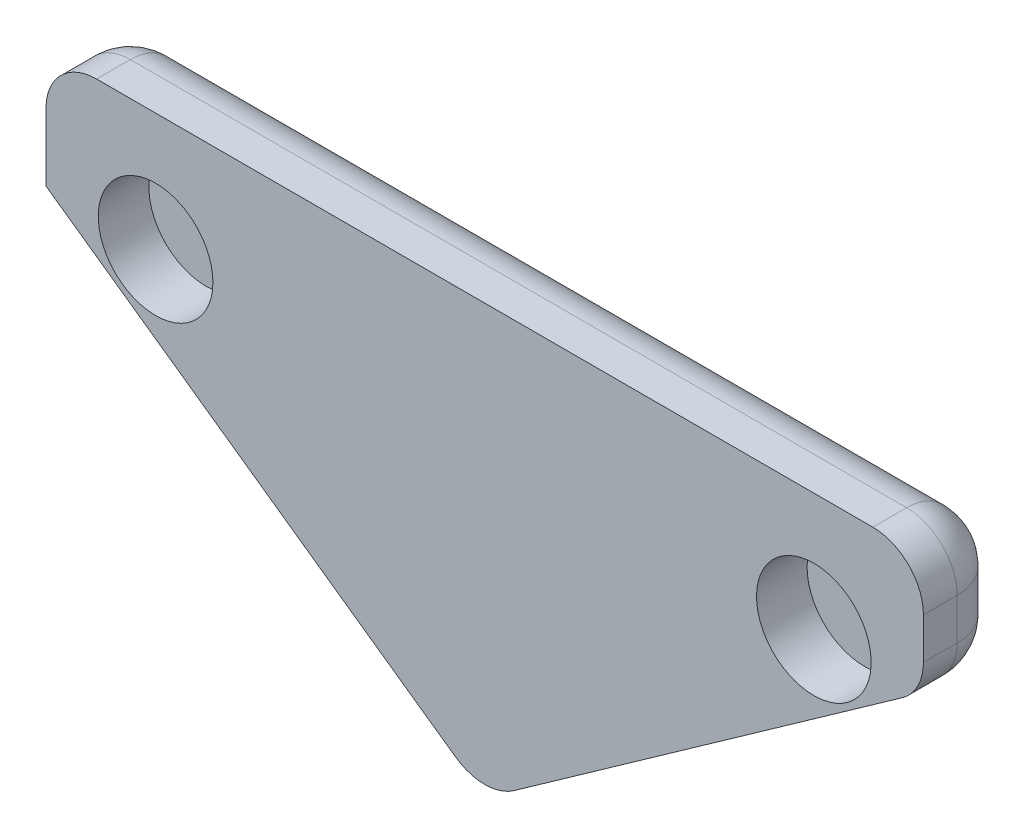
ISO-10303-21;
HEADER;
FILE_DESCRIPTION(('STEP AP214'),'2;1');
FILE_NAME('part.step','',(''),(''),'','','');
FILE_SCHEMA(('AUTOMOTIVE_DESIGN { 1 0 10303 214 1 1 1 1 }'));
ENDSEC;
DATA;
#1=APPLICATION_CONTEXT('core data for automotive mechanical design processes');
#2=APPLICATION_PROTOCOL_DEFINITION('international standard','automotive_design',2000,#1);
#3=PRODUCT_CONTEXT('',#1,'mechanical');
#4=PRODUCT('Part','Part','',(#3));
#5=PRODUCT_RELATED_PRODUCT_CATEGORY('part','',(#4));
#6=PRODUCT_DEFINITION_FORMATION('','',#4);
#7=PRODUCT_DEFINITION_CONTEXT('part definition',#1,'design');
#8=PRODUCT_DEFINITION('design','',#6,#7);
#9=PRODUCT_DEFINITION_SHAPE('','',#8);
#10=(LENGTH_UNIT() NAMED_UNIT(*) SI_UNIT(.MILLI.,.METRE.));
#11=(NAMED_UNIT(*) PLANE_ANGLE_UNIT() SI_UNIT($,.RADIAN.));
#12=(NAMED_UNIT(*) SI_UNIT($,.STERADIAN.) SOLID_ANGLE_UNIT());
#13=UNCERTAINTY_MEASURE_WITH_UNIT(LENGTH_MEASURE(1.E-05),#10,'distance_accuracy_value','');
#14=(GEOMETRIC_REPRESENTATION_CONTEXT(3) GLOBAL_UNCERTAINTY_ASSIGNED_CONTEXT((#13)) GLOBAL_UNIT_ASSIGNED_CONTEXT((#10,
#11,#12)) REPRESENTATION_CONTEXT('',''));
#15=CARTESIAN_POINT('',(0.,0.,0.));
#16=DIRECTION('',(0.,0.,1.));
#17=DIRECTION('',(1.,0.,0.));
#18=AXIS2_PLACEMENT_3D('',#15,#16,#17);
#19=CARTESIAN_POINT('',(5.44580381973494,12.7,2.5));
#20=DIRECTION('',(0.,-1.,0.));
#21=DIRECTION('',(1.,0.,0.));
#22=AXIS2_PLACEMENT_3D('',#19,#20,#21);
#23=PLANE('',#22);
#24=DIRECTION('',(-1.,0.,0.));
#25=VECTOR('',#24,1.);
#26=CARTESIAN_POINT('',(5.44580381973494,12.7,2.5));
#27=LINE('',#26,#25);
#28=CARTESIAN_POINT('',(16.9558038197349,12.7,2.5));
#29=VERTEX_POINT('',#28);
#30=CARTESIAN_POINT('',(-6.06419618026506,12.7,2.5));
#31=VERTEX_POINT('',#30);
#32=EDGE_CURVE('E145',#29,#31,#27,.T.);
#33=ORIENTED_EDGE('',*,*,#32,.F.);
#34=DIRECTION('',(0.,0.,-1.));
#35=VECTOR('',#34,1.);
#36=CARTESIAN_POINT('',(16.9558038197349,12.7,2.5));
#37=LINE('',#36,#35);
#38=CARTESIAN_POINT('',(16.9558038197349,12.7,1.5));
#39=VERTEX_POINT('',#38);
#40=EDGE_CURVE('E163',#29,#39,#37,.T.);
#41=ORIENTED_EDGE('',*,*,#40,.T.);
#42=DIRECTION('',(-1.,0.,0.));
#43=VECTOR('',#42,1.);
#44=CARTESIAN_POINT('',(5.44580381973494,12.7,1.5));
#45=LINE('',#44,#43);
#46=CARTESIAN_POINT('',(-6.06419618026506,12.7,1.5));
#47=VERTEX_POINT('',#46);
#48=EDGE_CURVE('E150',#39,#47,#45,.T.);
#49=ORIENTED_EDGE('',*,*,#48,.T.);
#50=DIRECTION('',(0.,0.,-1.));
#51=VECTOR('',#50,1.);
#52=CARTESIAN_POINT('',(-6.06419618026506,12.7,2.5));
#53=LINE('',#52,#51);
#54=EDGE_CURVE('E160',#47,#31,#53,.F.);
#55=ORIENTED_EDGE('',*,*,#54,.T.);
#56=EDGE_LOOP('',(#33,#41,#49,#55));
#57=FACE_BOUND('',#56,.T.);
#58=ADVANCED_FACE('F45',(#57),#23,.F.);
#59=CARTESIAN_POINT('',(-7.56419618026505,12.7,2.5));
#60=DIRECTION('',(1.,0.,0.));
#61=DIRECTION('',(0.,1.,0.));
#62=AXIS2_PLACEMENT_3D('',#59,#60,#61);
#63=PLANE('',#62);
#64=DIRECTION('',(0.,-1.,0.));
#65=VECTOR('',#64,1.);
#66=CARTESIAN_POINT('',(-7.56419618026505,12.7,2.5));
#67=LINE('',#66,#65);
#68=CARTESIAN_POINT('',(-7.56419618026506,11.2,2.5));
#69=VERTEX_POINT('',#68);
#70=CARTESIAN_POINT('',(-7.56419618026506,9.19999999999999,2.5));
#71=VERTEX_POINT('',#70);
#72=EDGE_CURVE('E133',#69,#71,#67,.T.);
#73=ORIENTED_EDGE('',*,*,#72,.F.);
#74=DIRECTION('',(0.,0.,-1.));
#75=VECTOR('',#74,1.);
#76=CARTESIAN_POINT('',(-7.56419618026506,11.2,2.5));
#77=LINE('',#76,#75);
#78=CARTESIAN_POINT('',(-7.56419618026506,11.2,1.5));
#79=VERTEX_POINT('',#78);
#80=EDGE_CURVE('E11',#69,#79,#77,.T.);
#81=ORIENTED_EDGE('',*,*,#80,.T.);
#82=DIRECTION('',(0.,-1.,0.));
#83=VECTOR('',#82,1.);
#84=CARTESIAN_POINT('',(-7.56419618026505,12.7,1.5));
#85=LINE('',#84,#83);
#86=CARTESIAN_POINT('',(-7.56419618026506,9.19999999999999,1.5));
#87=VERTEX_POINT('',#86);
#88=EDGE_CURVE('E55',#79,#87,#85,.T.);
#89=ORIENTED_EDGE('',*,*,#88,.T.);
#90=DIRECTION('',(0.,0.,-1.));
#91=VECTOR('',#90,1.);
#92=CARTESIAN_POINT('',(-7.56419618026506,9.19999999999999,2.5));
#93=LINE('',#92,#91);
#94=EDGE_CURVE('E147',#71,#87,#93,.T.);
#95=ORIENTED_EDGE('',*,*,#94,.F.);
#96=EDGE_LOOP('',(#73,#81,#89,#95));
#97=FACE_BOUND('',#96,.T.);
#98=ADVANCED_FACE('F148',(#97),#63,.F.);
#99=CARTESIAN_POINT('',(-7.56419618026506,9.19999999999999,2.5));
#100=DIRECTION('',(0.577372894319039,0.816480582075076,0.));
#101=DIRECTION('',(-0.816480582075076,0.577372894319039,0.));
#102=AXIS2_PLACEMENT_3D('',#99,#100,#101);
#103=PLANE('',#102);
#104=DIRECTION('',(0.816480582075076,-0.577372894319039,0.));
#105=VECTOR('',#104,1.);
#106=CARTESIAN_POINT('',(-7.56419618026506,9.19999999999999,1.5));
#107=LINE('',#106,#105);
#108=CARTESIAN_POINT('',(4.57974447825638,0.612432432098591,1.5));
#109=VERTEX_POINT('',#108);
#110=EDGE_CURVE('E69',#87,#109,#107,.T.);
#111=ORIENTED_EDGE('',*,*,#110,.T.);
#112=DIRECTION('',(0.,0.,-1.));
#113=VECTOR('',#112,1.);
#114=CARTESIAN_POINT('',(4.57974447825638,0.612432432098591,2.5));
#115=LINE('',#114,#113);
#116=CARTESIAN_POINT('',(4.57974447825638,0.612432432098591,2.5));
#117=VERTEX_POINT('',#116);
#118=EDGE_CURVE('E153',#109,#117,#115,.F.);
#119=ORIENTED_EDGE('',*,*,#118,.T.);
#120=DIRECTION('',(0.816480582075076,-0.577372894319039,0.));
#121=VECTOR('',#120,1.);
#122=CARTESIAN_POINT('',(-7.56419618026506,9.19999999999999,2.5));
#123=LINE('',#122,#121);
#124=EDGE_CURVE('E139',#71,#117,#123,.T.);
#125=ORIENTED_EDGE('',*,*,#124,.F.);
#126=ORIENTED_EDGE('',*,*,#94,.T.);
#127=EDGE_LOOP('',(#111,#119,#125,#126));
#128=FACE_BOUND('',#127,.T.);
#129=ADVANCED_FACE('F152',(#128),#103,.F.);
#130=CARTESIAN_POINT('',(0.,0.,2.5));
#131=DIRECTION('',(0.,0.,1.));
#132=DIRECTION('',(1.,0.,0.));
#133=AXIS2_PLACEMENT_3D('',#130,#131,#132);
#134=PLANE('',#133);
#135=CARTESIAN_POINT('',(-4.31419618026505,9.2,2.5));
#136=DIRECTION('',(0.,0.,1.));
#137=DIRECTION('',(1.,0.,0.));
#138=AXIS2_PLACEMENT_3D('',#135,#136,#137);
#139=CIRCLE('',#138,1.7);
#140=CARTESIAN_POINT('',(-2.61419618026505,9.2,2.5));
#141=VERTEX_POINT('',#140);
#142=EDGE_CURVE('E286',#141,#141,#139,.T.);
#143=ORIENTED_EDGE('',*,*,#142,.F.);
#144=EDGE_LOOP('',(#143));
#145=FACE_BOUND('',#144,.T.);
#146=DIRECTION('',(0.,-1.,0.));
#147=VECTOR('',#146,1.);
#148=CARTESIAN_POINT('',(18.4558038197349,12.7,2.5));
#149=LINE('',#148,#147);
#150=CARTESIAN_POINT('',(18.4558038197349,11.2,2.5));
#151=VERTEX_POINT('',#150);
#152=CARTESIAN_POINT('',(18.4558038197349,9.97643078407362,2.5));
#153=VERTEX_POINT('',#152);
#154=EDGE_CURVE('E276',#151,#153,#149,.T.);
#155=ORIENTED_EDGE('',*,*,#154,.F.);
#156=CARTESIAN_POINT('',(16.9558038197349,11.2,2.5));
#157=DIRECTION('',(0.,0.,1.));
#158=DIRECTION('',(1.,0.,0.));
#159=AXIS2_PLACEMENT_3D('',#156,#157,#158);
#160=CIRCLE('',#159,1.5);
#161=EDGE_CURVE('E184',#151,#29,#160,.T.);
#162=ORIENTED_EDGE('',*,*,#161,.T.);
#163=ORIENTED_EDGE('',*,*,#32,.T.);
#164=CARTESIAN_POINT('',(-6.06419618026506,11.2,2.5));
#165=DIRECTION('',(0.,0.,1.));
#166=DIRECTION('',(1.,0.,0.));
#167=AXIS2_PLACEMENT_3D('',#164,#165,#166);
#168=CIRCLE('',#167,1.5);
#169=EDGE_CURVE('E143',#31,#69,#168,.T.);
#170=ORIENTED_EDGE('',*,*,#169,.T.);
#171=ORIENTED_EDGE('',*,*,#72,.T.);
#172=ORIENTED_EDGE('',*,*,#124,.T.);
#173=CARTESIAN_POINT('',(5.44580381973494,1.8371533052112,2.5));
#174=DIRECTION('',(0.,0.,1.));
#175=DIRECTION('',(1.,0.,0.));
#176=AXIS2_PLACEMENT_3D('',#173,#174,#175);
#177=CIRCLE('',#176,1.5);
#178=CARTESIAN_POINT('',(6.3118631612135,0.612432432098591,2.5));
#179=VERTEX_POINT('',#178);
#180=EDGE_CURVE('E178',#117,#179,#177,.T.);
#181=ORIENTED_EDGE('',*,*,#180,.T.);
#182=DIRECTION('',(-0.816480582075076,-0.577372894319039,0.));
#183=VECTOR('',#182,1.);
#184=CARTESIAN_POINT('',(18.4558038197349,9.19999999999999,2.5));
#185=LINE('',#184,#183);
#186=CARTESIAN_POINT('',(17.8218631612135,8.751709910961,2.5));
#187=VERTEX_POINT('',#186);
#188=EDGE_CURVE('E282',#187,#179,#185,.T.);
#189=ORIENTED_EDGE('',*,*,#188,.F.);
#190=CARTESIAN_POINT('',(16.9558038197349,9.97643078407362,2.5));
#191=DIRECTION('',(0.,0.,1.));
#192=DIRECTION('',(1.,0.,0.));
#193=AXIS2_PLACEMENT_3D('',#190,#191,#192);
#194=CIRCLE('',#193,1.5);
#195=EDGE_CURVE('E181',#187,#153,#194,.T.);
#196=ORIENTED_EDGE('',*,*,#195,.T.);
#197=EDGE_LOOP('',(#155,#162,#163,#170,#171,#172,#181,#189,#196));
#198=FACE_BOUND('',#197,.T.);
#199=CARTESIAN_POINT('',(15.2058038197349,9.2,2.5));
#200=DIRECTION('',(0.,0.,-1.));
#201=DIRECTION('',(-1.,0.,0.));
#202=AXIS2_PLACEMENT_3D('',#199,#200,#201);
#203=CIRCLE('',#202,1.7);
#204=CARTESIAN_POINT('',(13.5058038197349,9.2,2.5));
#205=VERTEX_POINT('',#204);
#206=EDGE_CURVE('E267',#205,#205,#203,.T.);
#207=ORIENTED_EDGE('',*,*,#206,.T.);
#208=EDGE_LOOP('',(#207));
#209=FACE_BOUND('',#208,.T.);
#210=ADVANCED_FACE('F136',(#145,#198,#209),#134,.T.);
#211=CARTESIAN_POINT('',(0.,0.,0.));
#212=DIRECTION('',(0.,0.,1.));
#213=DIRECTION('',(1.,0.,0.));
#214=AXIS2_PLACEMENT_3D('',#211,#212,#213);
#215=PLANE('',#214);
#216=DIRECTION('',(-1.,0.,0.));
#217=VECTOR('',#216,1.);
#218=CARTESIAN_POINT('',(0.,11.2,0.));
#219=LINE('',#218,#217);
#220=CARTESIAN_POINT('',(-6.06419618026506,11.2,0.));
#221=VERTEX_POINT('',#220);
#222=CARTESIAN_POINT('',(16.9558038197349,11.2,0.));
#223=VERTEX_POINT('',#222);
#224=EDGE_CURVE('E187',#221,#223,#219,.F.);
#225=ORIENTED_EDGE('',*,*,#224,.T.);
#226=DIRECTION('',(0.,-1.,0.));
#227=VECTOR('',#226,1.);
#228=CARTESIAN_POINT('',(16.955803819735,0.,0.));
#229=LINE('',#228,#227);
#230=CARTESIAN_POINT('',(16.9558038197349,9.97643078407362,0.));
#231=VERTEX_POINT('',#230);
#232=EDGE_CURVE('E199',#223,#231,#229,.T.);
#233=ORIENTED_EDGE('',*,*,#232,.T.);
#234=DIRECTION('',(-0.816480582075076,-0.577372894319039,0.));
#235=VECTOR('',#234,1.);
#236=CARTESIAN_POINT('',(0.949350874202201,-1.34250596449681,0.));
#237=LINE('',#236,#235);
#238=CARTESIAN_POINT('',(5.44580381973495,1.83715330521121,0.));
#239=VERTEX_POINT('',#238);
#240=EDGE_CURVE('E196',#231,#239,#237,.T.);
#241=ORIENTED_EDGE('',*,*,#240,.T.);
#242=DIRECTION('',(0.816480582075076,-0.577372894319039,0.));
#243=VECTOR('',#242,1.);
#244=CARTESIAN_POINT('',(2.68146955715931,3.79194771072203,0.));
#245=LINE('',#244,#243);
#246=CARTESIAN_POINT('',(-6.06419618026506,9.97643078407362,0.));
#247=VERTEX_POINT('',#246);
#248=EDGE_CURVE('E193',#239,#247,#245,.F.);
#249=ORIENTED_EDGE('',*,*,#248,.T.);
#250=DIRECTION('',(0.,-1.,0.));
#251=VECTOR('',#250,1.);
#252=CARTESIAN_POINT('',(-6.06419618026507,0.,0.));
#253=LINE('',#252,#251);
#254=EDGE_CURVE('E190',#247,#221,#253,.F.);
#255=ORIENTED_EDGE('',*,*,#254,.T.);
#256=EDGE_LOOP('',(#225,#233,#241,#249,#255));
#257=FACE_BOUND('',#256,.T.);
#258=ADVANCED_FACE('F315',(#257),#215,.F.);
#259=CARTESIAN_POINT('',(-4.31419618026505,9.2,1.));
#260=DIRECTION('',(0.,0.,1.));
#261=DIRECTION('',(1.,0.,0.));
#262=AXIS2_PLACEMENT_3D('',#259,#260,#261);
#263=CYLINDRICAL_SURFACE('',#262,1.7);
#264=CARTESIAN_POINT('',(-4.31419618026505,9.2,1.));
#265=DIRECTION('',(0.,0.,1.));
#266=DIRECTION('',(1.,0.,0.));
#267=AXIS2_PLACEMENT_3D('',#264,#265,#266);
#268=CIRCLE('',#267,1.7);
#269=CARTESIAN_POINT('',(-2.61419618026505,9.2,1.));
#270=VERTEX_POINT('',#269);
#271=EDGE_CURVE('E287',#270,#270,#268,.T.);
#272=ORIENTED_EDGE('',*,*,#271,.F.);
#273=EDGE_LOOP('',(#272));
#274=FACE_BOUND('',#273,.T.);
#275=ORIENTED_EDGE('',*,*,#142,.T.);
#276=EDGE_LOOP('',(#275));
#277=FACE_BOUND('',#276,.T.);
#278=ADVANCED_FACE('F520',(#274,#277),#263,.F.);
#279=CARTESIAN_POINT('',(-4.31419618026505,9.2,1.));
#280=DIRECTION('',(0.,0.,1.));
#281=DIRECTION('',(1.,0.,0.));
#282=AXIS2_PLACEMENT_3D('',#279,#280,#281);
#283=PLANE('',#282);
#284=ORIENTED_EDGE('',*,*,#271,.T.);
#285=EDGE_LOOP('',(#284));
#286=FACE_BOUND('',#285,.T.);
#287=ADVANCED_FACE('F507',(#286),#283,.T.);
#288=CARTESIAN_POINT('',(18.4558038197349,12.7,2.5));
#289=DIRECTION('',(-1.,0.,0.));
#290=DIRECTION('',(0.,1.,0.));
#291=AXIS2_PLACEMENT_3D('',#288,#289,#290);
#292=PLANE('',#291);
#293=DIRECTION('',(0.,-1.,0.));
#294=VECTOR('',#293,1.);
#295=CARTESIAN_POINT('',(18.4558038197349,12.7,1.5));
#296=LINE('',#295,#294);
#297=CARTESIAN_POINT('',(18.4558038197349,9.97643078407362,1.5));
#298=VERTEX_POINT('',#297);
#299=CARTESIAN_POINT('',(18.4558038197349,11.2,1.5));
#300=VERTEX_POINT('',#299);
#301=EDGE_CURVE('E170',#298,#300,#296,.F.);
#302=ORIENTED_EDGE('',*,*,#301,.T.);
#303=DIRECTION('',(0.,0.,-1.));
#304=VECTOR('',#303,1.);
#305=CARTESIAN_POINT('',(18.4558038197349,11.2,2.5));
#306=LINE('',#305,#304);
#307=EDGE_CURVE('E173',#300,#151,#306,.F.);
#308=ORIENTED_EDGE('',*,*,#307,.T.);
#309=ORIENTED_EDGE('',*,*,#154,.T.);
#310=DIRECTION('',(0.,0.,-1.));
#311=VECTOR('',#310,1.);
#312=CARTESIAN_POINT('',(18.4558038197349,9.97643078407362,2.5));
#313=LINE('',#312,#311);
#314=EDGE_CURVE('E167',#153,#298,#313,.T.);
#315=ORIENTED_EDGE('',*,*,#314,.T.);
#316=EDGE_LOOP('',(#302,#308,#309,#315));
#317=FACE_BOUND('',#316,.T.);
#318=ADVANCED_FACE('F493',(#317),#292,.F.);
#319=CARTESIAN_POINT('',(18.4558038197349,9.19999999999999,2.5));
#320=DIRECTION('',(-0.577372894319039,0.816480582075076,0.));
#321=DIRECTION('',(0.816480582075076,0.577372894319039,0.));
#322=AXIS2_PLACEMENT_3D('',#319,#320,#321);
#323=PLANE('',#322);
#324=DIRECTION('',(-0.816480582075076,-0.577372894319039,0.));
#325=VECTOR('',#324,1.);
#326=CARTESIAN_POINT('',(18.4558038197349,9.19999999999999,1.5));
#327=LINE('',#326,#325);
#328=CARTESIAN_POINT('',(6.3118631612135,0.61243243209859,1.5));
#329=VERTEX_POINT('',#328);
#330=CARTESIAN_POINT('',(17.8218631612135,8.751709910961,1.5));
#331=VERTEX_POINT('',#330);
#332=EDGE_CURVE('E206',#329,#331,#327,.F.);
#333=ORIENTED_EDGE('',*,*,#332,.T.);
#334=DIRECTION('',(0.,0.,-1.));
#335=VECTOR('',#334,1.);
#336=CARTESIAN_POINT('',(17.8218631612135,8.751709910961,2.5));
#337=LINE('',#336,#335);
#338=EDGE_CURVE('E209',#331,#187,#337,.F.);
#339=ORIENTED_EDGE('',*,*,#338,.T.);
#340=ORIENTED_EDGE('',*,*,#188,.T.);
#341=DIRECTION('',(0.,0.,-1.));
#342=VECTOR('',#341,1.);
#343=CARTESIAN_POINT('',(6.3118631612135,0.612432432098591,2.5));
#344=LINE('',#343,#342);
#345=EDGE_CURVE('E203',#179,#329,#344,.T.);
#346=ORIENTED_EDGE('',*,*,#345,.T.);
#347=EDGE_LOOP('',(#333,#339,#340,#346));
#348=FACE_BOUND('',#347,.T.);
#349=ADVANCED_FACE('F486',(#348),#323,.F.);
#350=CARTESIAN_POINT('',(15.2058038197349,9.2,1.));
#351=DIRECTION('',(0.,0.,1.));
#352=DIRECTION('',(-1.,0.,0.));
#353=AXIS2_PLACEMENT_3D('',#350,#351,#352);
#354=CYLINDRICAL_SURFACE('',#353,1.7);
#355=CARTESIAN_POINT('',(15.2058038197349,9.2,1.));
#356=DIRECTION('',(0.,0.,-1.));
#357=DIRECTION('',(-1.,0.,0.));
#358=AXIS2_PLACEMENT_3D('',#355,#356,#357);
#359=CIRCLE('',#358,1.7);
#360=CARTESIAN_POINT('',(13.5058038197349,9.2,1.));
#361=VERTEX_POINT('',#360);
#362=EDGE_CURVE('E271',#361,#361,#359,.T.);
#363=ORIENTED_EDGE('',*,*,#362,.T.);
#364=EDGE_LOOP('',(#363));
#365=FACE_BOUND('',#364,.T.);
#366=ORIENTED_EDGE('',*,*,#206,.F.);
#367=EDGE_LOOP('',(#366));
#368=FACE_BOUND('',#367,.T.);
#369=ADVANCED_FACE('F492',(#365,#368),#354,.F.);
#370=CARTESIAN_POINT('',(15.2058038197349,9.2,1.));
#371=DIRECTION('',(0.,0.,1.));
#372=DIRECTION('',(-1.,0.,0.));
#373=AXIS2_PLACEMENT_3D('',#370,#371,#372);
#374=PLANE('',#373);
#375=ORIENTED_EDGE('',*,*,#362,.F.);
#376=EDGE_LOOP('',(#375));
#377=FACE_BOUND('',#376,.T.);
#378=ADVANCED_FACE('F478',(#377),#374,.T.);
#379=CARTESIAN_POINT('',(5.44580381973494,1.8371533052112,2.5));
#380=DIRECTION('',(0.,0.,-1.));
#381=DIRECTION('',(-1.,0.,0.));
#382=AXIS2_PLACEMENT_3D('',#379,#380,#381);
#383=CYLINDRICAL_SURFACE('',#382,1.5);
#384=ORIENTED_EDGE('',*,*,#180,.F.);
#385=ORIENTED_EDGE('',*,*,#118,.F.);
#386=CARTESIAN_POINT('',(5.44580381973494,1.83715330521121,1.5));
#387=DIRECTION('',(0.,0.,-1.));
#388=DIRECTION('',(-1.,0.,0.));
#389=AXIS2_PLACEMENT_3D('',#386,#387,#388);
#390=CIRCLE('',#389,1.5);
#391=EDGE_CURVE('E259',#329,#109,#390,.T.);
#392=ORIENTED_EDGE('',*,*,#391,.F.);
#393=ORIENTED_EDGE('',*,*,#345,.F.);
#394=EDGE_LOOP('',(#384,#385,#392,#393));
#395=FACE_BOUND('',#394,.T.);
#396=ADVANCED_FACE('F47',(#395),#383,.T.);
#397=CARTESIAN_POINT('',(-6.6981368387865,10.4247208731126,1.5));
#398=DIRECTION('',(0.816480582075076,-0.577372894319039,0.));
#399=DIRECTION('',(0.577372894319039,0.816480582075076,0.));
#400=AXIS2_PLACEMENT_3D('',#397,#398,#399);
#401=CYLINDRICAL_SURFACE('',#400,1.5);
#402=CARTESIAN_POINT('',(5.44580381973494,1.83715330521121,1.5));
#403=DIRECTION('',(0.816480582075076,-0.577372894319039,0.));
#404=DIRECTION('',(0.577372894319039,0.816480582075076,0.));
#405=AXIS2_PLACEMENT_3D('',#402,#403,#404);
#406=CIRCLE('',#405,1.5);
#407=EDGE_CURVE('E49',#109,#239,#406,.T.);
#408=ORIENTED_EDGE('',*,*,#407,.F.);
#409=ORIENTED_EDGE('',*,*,#110,.F.);
#410=CARTESIAN_POINT('',(-6.06419618026506,9.97643078407362,1.5));
#411=DIRECTION('',(0.459688538948362,-0.888080203112039,0.));
#412=DIRECTION('',(-0.888080203112039,-0.459688538948362,0.));
#413=AXIS2_PLACEMENT_3D('',#410,#411,#412);
#414=ELLIPSE('',#413,1.68903663739339,1.5);
#415=EDGE_CURVE('E256',#247,#87,#414,.F.);
#416=ORIENTED_EDGE('',*,*,#415,.F.);
#417=ORIENTED_EDGE('',*,*,#248,.F.);
#418=EDGE_LOOP('',(#408,#409,#416,#417));
#419=FACE_BOUND('',#418,.T.);
#420=ADVANCED_FACE('F313',(#419),#401,.T.);
#421=CARTESIAN_POINT('',(5.44580381973495,1.8371533052112,1.5));
#422=DIRECTION('',(0.,0.,-1.));
#423=DIRECTION('',(0.,1.,0.));
#424=AXIS2_PLACEMENT_3D('',#421,#422,#423);
#425=SPHERICAL_SURFACE('',#424,1.5);
#426=ORIENTED_EDGE('',*,*,#391,.T.);
#427=ORIENTED_EDGE('',*,*,#407,.T.);
#428=CARTESIAN_POINT('',(5.44580381973495,1.83715330521121,1.5));
#429=DIRECTION('',(-0.816480582075078,-0.577372894319037,0.));
#430=DIRECTION('',(0.577372894319037,-0.816480582075078,0.));
#431=AXIS2_PLACEMENT_3D('',#428,#429,#430);
#432=CIRCLE('',#431,1.5);
#433=EDGE_CURVE('E252',#329,#239,#432,.F.);
#434=ORIENTED_EDGE('',*,*,#433,.F.);
#435=EDGE_LOOP('',(#426,#427,#434));
#436=FACE_BOUND('',#435,.T.);
#437=ADVANCED_FACE('F322',(#436),#425,.T.);
#438=CARTESIAN_POINT('',(-6.06419618026506,11.2,2.5));
#439=DIRECTION('',(0.,0.,-1.));
#440=DIRECTION('',(-1.,0.,0.));
#441=AXIS2_PLACEMENT_3D('',#438,#439,#440);
#442=CYLINDRICAL_SURFACE('',#441,1.5);
#443=ORIENTED_EDGE('',*,*,#169,.F.);
#444=ORIENTED_EDGE('',*,*,#54,.F.);
#445=CARTESIAN_POINT('',(-6.06419618026506,11.2,1.5));
#446=DIRECTION('',(0.,0.,-1.));
#447=DIRECTION('',(-1.,0.,0.));
#448=AXIS2_PLACEMENT_3D('',#445,#446,#447);
#449=CIRCLE('',#448,1.5);
#450=EDGE_CURVE('E248',#79,#47,#449,.T.);
#451=ORIENTED_EDGE('',*,*,#450,.F.);
#452=ORIENTED_EDGE('',*,*,#80,.F.);
#453=EDGE_LOOP('',(#443,#444,#451,#452));
#454=FACE_BOUND('',#453,.T.);
#455=ADVANCED_FACE('F300',(#454),#442,.T.);
#456=CARTESIAN_POINT('',(-6.06419618026505,12.7,1.5));
#457=DIRECTION('',(0.,-1.,0.));
#458=DIRECTION('',(1.,0.,0.));
#459=AXIS2_PLACEMENT_3D('',#456,#457,#458);
#460=CYLINDRICAL_SURFACE('',#459,1.5);
#461=ORIENTED_EDGE('',*,*,#415,.T.);
#462=ORIENTED_EDGE('',*,*,#88,.F.);
#463=CARTESIAN_POINT('',(-6.06419618026506,11.2,1.5));
#464=DIRECTION('',(0.,1.,0.));
#465=DIRECTION('',(-1.,0.,0.));
#466=AXIS2_PLACEMENT_3D('',#463,#464,#465);
#467=CIRCLE('',#466,1.5);
#468=EDGE_CURVE('E244',#221,#79,#467,.T.);
#469=ORIENTED_EDGE('',*,*,#468,.F.);
#470=ORIENTED_EDGE('',*,*,#254,.F.);
#471=EDGE_LOOP('',(#461,#462,#469,#470));
#472=FACE_BOUND('',#471,.T.);
#473=ADVANCED_FACE('F309',(#472),#460,.T.);
#474=CARTESIAN_POINT('',(0.949350874202201,-1.34250596449681,1.5));
#475=DIRECTION('',(-0.816480582075076,-0.577372894319039,0.));
#476=DIRECTION('',(0.577372894319039,-0.816480582075076,0.));
#477=AXIS2_PLACEMENT_3D('',#474,#475,#476);
#478=CYLINDRICAL_SURFACE('',#477,1.5);
#479=ORIENTED_EDGE('',*,*,#433,.T.);
#480=ORIENTED_EDGE('',*,*,#240,.F.);
#481=CARTESIAN_POINT('',(16.9558038197349,9.97643078407362,1.5));
#482=DIRECTION('',(0.816480582075076,0.577372894319039,0.));
#483=DIRECTION('',(-0.577372894319039,0.816480582075076,0.));
#484=AXIS2_PLACEMENT_3D('',#481,#482,#483);
#485=CIRCLE('',#484,1.5);
#486=EDGE_CURVE('E240',#331,#231,#485,.T.);
#487=ORIENTED_EDGE('',*,*,#486,.F.);
#488=ORIENTED_EDGE('',*,*,#332,.F.);
#489=EDGE_LOOP('',(#479,#480,#487,#488));
#490=FACE_BOUND('',#489,.T.);
#491=ADVANCED_FACE('F320',(#490),#478,.T.);
#492=CARTESIAN_POINT('',(16.9558038197349,9.97643078407362,2.5));
#493=DIRECTION('',(0.,0.,-1.));
#494=DIRECTION('',(-1.,0.,0.));
#495=AXIS2_PLACEMENT_3D('',#492,#493,#494);
#496=CYLINDRICAL_SURFACE('',#495,1.5);
#497=ORIENTED_EDGE('',*,*,#195,.F.);
#498=ORIENTED_EDGE('',*,*,#338,.F.);
#499=CARTESIAN_POINT('',(16.9558038197349,9.97643078407362,1.5));
#500=DIRECTION('',(0.,0.,-1.));
#501=DIRECTION('',(-1.,0.,0.));
#502=AXIS2_PLACEMENT_3D('',#499,#500,#501);
#503=CIRCLE('',#502,1.5);
#504=EDGE_CURVE('E236',#298,#331,#503,.T.);
#505=ORIENTED_EDGE('',*,*,#504,.F.);
#506=ORIENTED_EDGE('',*,*,#314,.F.);
#507=EDGE_LOOP('',(#497,#498,#505,#506));
#508=FACE_BOUND('',#507,.T.);
#509=ADVANCED_FACE('F360',(#508),#496,.T.);
#510=CARTESIAN_POINT('',(-6.06419618026506,11.2,1.5));
#511=DIRECTION('',(-1.,0.,0.));
#512=DIRECTION('',(0.,-1.,0.));
#513=AXIS2_PLACEMENT_3D('',#510,#511,#512);
#514=SPHERICAL_SURFACE('',#513,1.5);
#515=ORIENTED_EDGE('',*,*,#468,.T.);
#516=ORIENTED_EDGE('',*,*,#450,.T.);
#517=CARTESIAN_POINT('',(-6.06419618026506,11.2,1.5));
#518=DIRECTION('',(-1.,0.,0.));
#519=DIRECTION('',(0.,0.,1.));
#520=AXIS2_PLACEMENT_3D('',#517,#518,#519);
#521=CIRCLE('',#520,1.5);
#522=EDGE_CURVE('E232',#221,#47,#521,.F.);
#523=ORIENTED_EDGE('',*,*,#522,.F.);
#524=EDGE_LOOP('',(#515,#516,#523));
#525=FACE_BOUND('',#524,.T.);
#526=ADVANCED_FACE('F305',(#525),#514,.T.);
#527=CARTESIAN_POINT('',(16.9558038197349,9.97643078407362,1.5));
#528=DIRECTION('',(0.,0.,-1.));
#529=DIRECTION('',(-1.,0.,0.));
#530=AXIS2_PLACEMENT_3D('',#527,#528,#529);
#531=SPHERICAL_SURFACE('',#530,1.5);
#532=ORIENTED_EDGE('',*,*,#504,.T.);
#533=ORIENTED_EDGE('',*,*,#486,.T.);
#534=CARTESIAN_POINT('',(16.9558038197349,9.97643078407362,1.5));
#535=DIRECTION('',(0.,-1.,0.));
#536=DIRECTION('',(1.,0.,0.));
#537=AXIS2_PLACEMENT_3D('',#534,#535,#536);
#538=CIRCLE('',#537,1.5);
#539=EDGE_CURVE('E229',#298,#231,#538,.F.);
#540=ORIENTED_EDGE('',*,*,#539,.F.);
#541=EDGE_LOOP('',(#532,#533,#540));
#542=FACE_BOUND('',#541,.T.);
#543=ADVANCED_FACE('F353',(#542),#531,.T.);
#544=CARTESIAN_POINT('',(5.44580381973494,11.2,1.5));
#545=DIRECTION('',(-1.,0.,0.));
#546=DIRECTION('',(0.,-1.,0.));
#547=AXIS2_PLACEMENT_3D('',#544,#545,#546);
#548=CYLINDRICAL_SURFACE('',#547,1.5);
#549=ORIENTED_EDGE('',*,*,#522,.T.);
#550=ORIENTED_EDGE('',*,*,#48,.F.);
#551=CARTESIAN_POINT('',(16.9558038197349,11.2,1.5));
#552=DIRECTION('',(1.,0.,0.));
#553=DIRECTION('',(0.,1.,0.));
#554=AXIS2_PLACEMENT_3D('',#551,#552,#553);
#555=CIRCLE('',#554,1.5);
#556=EDGE_CURVE('E225',#223,#39,#555,.T.);
#557=ORIENTED_EDGE('',*,*,#556,.F.);
#558=ORIENTED_EDGE('',*,*,#224,.F.);
#559=EDGE_LOOP('',(#549,#550,#557,#558));
#560=FACE_BOUND('',#559,.T.);
#561=ADVANCED_FACE('F349',(#560),#548,.T.);
#562=CARTESIAN_POINT('',(16.955803819735,0.,1.5));
#563=DIRECTION('',(0.,-1.,0.));
#564=DIRECTION('',(1.,0.,0.));
#565=AXIS2_PLACEMENT_3D('',#562,#563,#564);
#566=CYLINDRICAL_SURFACE('',#565,1.5);
#567=ORIENTED_EDGE('',*,*,#539,.T.);
#568=ORIENTED_EDGE('',*,*,#232,.F.);
#569=CARTESIAN_POINT('',(16.9558038197349,11.2,1.5));
#570=DIRECTION('',(0.,1.,0.));
#571=DIRECTION('',(-1.,0.,0.));
#572=AXIS2_PLACEMENT_3D('',#569,#570,#571);
#573=CIRCLE('',#572,1.5);
#574=EDGE_CURVE('E221',#300,#223,#573,.T.);
#575=ORIENTED_EDGE('',*,*,#574,.F.);
#576=ORIENTED_EDGE('',*,*,#301,.F.);
#577=EDGE_LOOP('',(#567,#568,#575,#576));
#578=FACE_BOUND('',#577,.T.);
#579=ADVANCED_FACE('F345',(#578),#566,.T.);
#580=CARTESIAN_POINT('',(16.9558038197349,11.2,1.5));
#581=DIRECTION('',(0.,0.,-1.));
#582=DIRECTION('',(-1.,0.,0.));
#583=AXIS2_PLACEMENT_3D('',#580,#581,#582);
#584=SPHERICAL_SURFACE('',#583,1.5);
#585=ORIENTED_EDGE('',*,*,#574,.T.);
#586=ORIENTED_EDGE('',*,*,#556,.T.);
#587=CARTESIAN_POINT('',(16.9558038197349,11.2,1.5));
#588=DIRECTION('',(0.,0.,-1.));
#589=DIRECTION('',(-1.,0.,0.));
#590=AXIS2_PLACEMENT_3D('',#587,#588,#589);
#591=CIRCLE('',#590,1.5);
#592=EDGE_CURVE('E218',#300,#39,#591,.F.);
#593=ORIENTED_EDGE('',*,*,#592,.F.);
#594=EDGE_LOOP('',(#585,#586,#593));
#595=FACE_BOUND('',#594,.T.);
#596=ADVANCED_FACE('F341',(#595),#584,.T.);
#597=CARTESIAN_POINT('',(16.9558038197349,11.2,2.5));
#598=DIRECTION('',(0.,0.,-1.));
#599=DIRECTION('',(-1.,0.,0.));
#600=AXIS2_PLACEMENT_3D('',#597,#598,#599);
#601=CYLINDRICAL_SURFACE('',#600,1.5);
#602=ORIENTED_EDGE('',*,*,#161,.F.);
#603=ORIENTED_EDGE('',*,*,#307,.F.);
#604=ORIENTED_EDGE('',*,*,#592,.T.);
#605=ORIENTED_EDGE('',*,*,#40,.F.);
#606=EDGE_LOOP('',(#602,#603,#604,#605));
#607=FACE_BOUND('',#606,.T.);
#608=ADVANCED_FACE('F338',(#607),#601,.T.);
#609=CLOSED_SHELL('',(#58,#98,#129,#210,#258,#278,#287,#318,#349,#369,#378,#396,#420,#437,#455,
#473,#491,#509,#526,#543,#561,#579,#596,#608));
#610=MANIFOLD_SOLID_BREP('B2',#609);
#611=ADVANCED_BREP_SHAPE_REPRESENTATION('',(#18,#610),#14);
#612=SHAPE_DEFINITION_REPRESENTATION(#9,#611);
ENDSEC;
END-ISO-10303-21;
